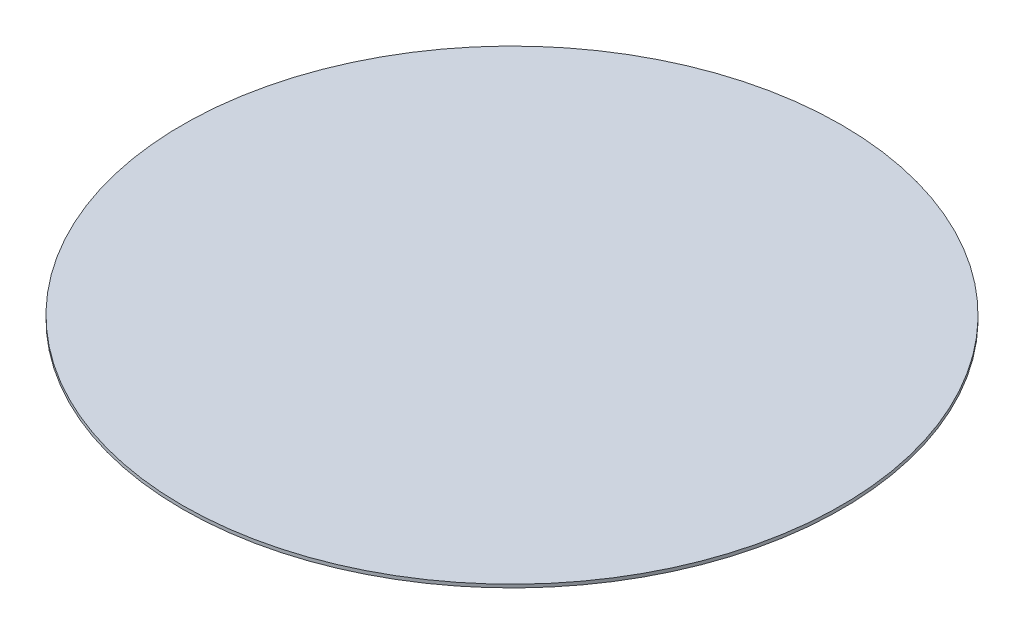
ISO-10303-21;
HEADER;
FILE_DESCRIPTION(('STEP AP214'),'2;1');
FILE_NAME('part.step','',(''),(''),'','','');
FILE_SCHEMA(('AUTOMOTIVE_DESIGN { 1 0 10303 214 1 1 1 1 }'));
ENDSEC;
DATA;
#1=APPLICATION_CONTEXT('core data for automotive mechanical design processes');
#2=APPLICATION_PROTOCOL_DEFINITION('international standard','automotive_design',2000,#1);
#3=PRODUCT_CONTEXT('',#1,'mechanical');
#4=PRODUCT('Part','Part','',(#3));
#5=PRODUCT_RELATED_PRODUCT_CATEGORY('part','',(#4));
#6=PRODUCT_DEFINITION_FORMATION('','',#4);
#7=PRODUCT_DEFINITION_CONTEXT('part definition',#1,'design');
#8=PRODUCT_DEFINITION('design','',#6,#7);
#9=PRODUCT_DEFINITION_SHAPE('','',#8);
#10=(LENGTH_UNIT() NAMED_UNIT(*) SI_UNIT(.MILLI.,.METRE.));
#11=(NAMED_UNIT(*) PLANE_ANGLE_UNIT() SI_UNIT($,.RADIAN.));
#12=(NAMED_UNIT(*) SI_UNIT($,.STERADIAN.) SOLID_ANGLE_UNIT());
#13=UNCERTAINTY_MEASURE_WITH_UNIT(LENGTH_MEASURE(1.E-05),#10,'distance_accuracy_value','');
#14=(GEOMETRIC_REPRESENTATION_CONTEXT(3) GLOBAL_UNCERTAINTY_ASSIGNED_CONTEXT((#13)) GLOBAL_UNIT_ASSIGNED_CONTEXT((#10,
#11,#12)) REPRESENTATION_CONTEXT('',''));
#15=CARTESIAN_POINT('',(0.,0.,0.));
#16=DIRECTION('',(0.,0.,1.));
#17=DIRECTION('',(1.,0.,0.));
#18=AXIS2_PLACEMENT_3D('',#15,#16,#17);
#19=CARTESIAN_POINT('',(0.,0.254,0.));
#20=DIRECTION('',(0.,-1.,0.));
#21=DIRECTION('',(0.,0.,-1.));
#22=AXIS2_PLACEMENT_3D('',#19,#20,#21);
#23=CYLINDRICAL_SURFACE('',#22,25.81275);
#24=CARTESIAN_POINT('',(0.,0.254,0.));
#25=DIRECTION('',(0.,1.,0.));
#26=DIRECTION('',(0.,0.,1.));
#27=AXIS2_PLACEMENT_3D('',#24,#25,#26);
#28=CIRCLE('',#27,25.81275);
#29=CARTESIAN_POINT('',(0.,0.254,25.81275));
#30=VERTEX_POINT('',#29);
#31=EDGE_CURVE('E10',#30,#30,#28,.T.);
#32=ORIENTED_EDGE('',*,*,#31,.F.);
#33=EDGE_LOOP('',(#32));
#34=FACE_BOUND('',#33,.T.);
#35=CARTESIAN_POINT('',(0.,0.,0.));
#36=DIRECTION('',(0.,1.,0.));
#37=DIRECTION('',(0.,0.,1.));
#38=AXIS2_PLACEMENT_3D('',#35,#36,#37);
#39=CIRCLE('',#38,25.81275);
#40=CARTESIAN_POINT('',(0.,0.,25.81275));
#41=VERTEX_POINT('',#40);
#42=EDGE_CURVE('E40',#41,#41,#39,.T.);
#43=ORIENTED_EDGE('',*,*,#42,.T.);
#44=EDGE_LOOP('',(#43));
#45=FACE_BOUND('',#44,.T.);
#46=ADVANCED_FACE('F37',(#34,#45),#23,.T.);
#47=CARTESIAN_POINT('',(0.,0.254,0.));
#48=DIRECTION('',(0.,1.,0.));
#49=DIRECTION('',(0.,0.,1.));
#50=AXIS2_PLACEMENT_3D('',#47,#48,#49);
#51=PLANE('',#50);
#52=ORIENTED_EDGE('',*,*,#31,.T.);
#53=EDGE_LOOP('',(#52));
#54=FACE_BOUND('',#53,.T.);
#55=ADVANCED_FACE('F54',(#54),#51,.T.);
#56=CARTESIAN_POINT('',(0.,0.,0.));
#57=DIRECTION('',(0.,1.,0.));
#58=DIRECTION('',(0.,0.,1.));
#59=AXIS2_PLACEMENT_3D('',#56,#57,#58);
#60=PLANE('',#59);
#61=ORIENTED_EDGE('',*,*,#42,.F.);
#62=EDGE_LOOP('',(#61));
#63=FACE_BOUND('',#62,.T.);
#64=ADVANCED_FACE('F52',(#63),#60,.F.);
#65=CLOSED_SHELL('',(#46,#55,#64));
#66=MANIFOLD_SOLID_BREP('B2',#65);
#67=ADVANCED_BREP_SHAPE_REPRESENTATION('',(#18,#66),#14);
#68=SHAPE_DEFINITION_REPRESENTATION(#9,#67);
ENDSEC;
END-ISO-10303-21;
